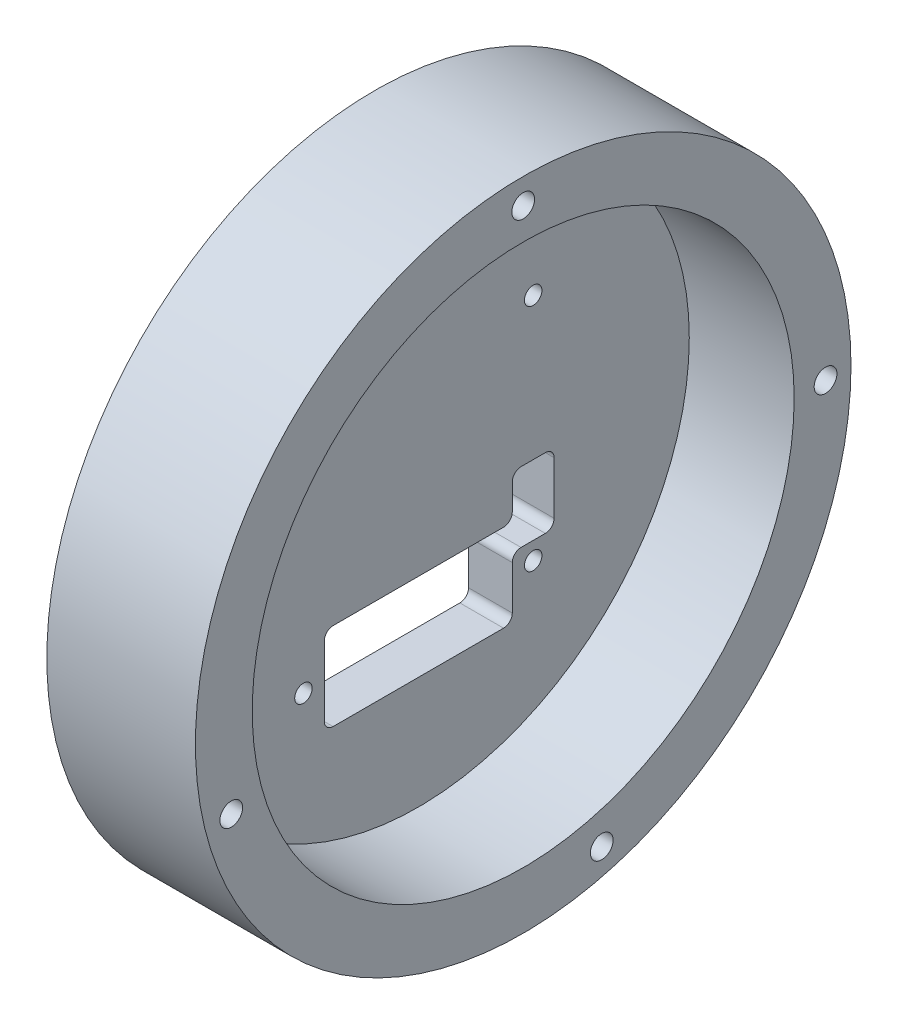
ISO-10303-21;
HEADER;
FILE_DESCRIPTION(('STEP AP214'),'2;1');
FILE_NAME('part.step','',(''),(''),'','','');
FILE_SCHEMA(('AUTOMOTIVE_DESIGN { 1 0 10303 214 1 1 1 1 }'));
ENDSEC;
DATA;
#1=APPLICATION_CONTEXT('core data for automotive mechanical design processes');
#2=APPLICATION_PROTOCOL_DEFINITION('international standard','automotive_design',2000,#1);
#3=PRODUCT_CONTEXT('',#1,'mechanical');
#4=PRODUCT('Part','Part','',(#3));
#5=PRODUCT_RELATED_PRODUCT_CATEGORY('part','',(#4));
#6=PRODUCT_DEFINITION_FORMATION('','',#4);
#7=PRODUCT_DEFINITION_CONTEXT('part definition',#1,'design');
#8=PRODUCT_DEFINITION('design','',#6,#7);
#9=PRODUCT_DEFINITION_SHAPE('','',#8);
#10=(LENGTH_UNIT() NAMED_UNIT(*) SI_UNIT(.MILLI.,.METRE.));
#11=(NAMED_UNIT(*) PLANE_ANGLE_UNIT() SI_UNIT($,.RADIAN.));
#12=(NAMED_UNIT(*) SI_UNIT($,.STERADIAN.) SOLID_ANGLE_UNIT());
#13=UNCERTAINTY_MEASURE_WITH_UNIT(LENGTH_MEASURE(1.E-05),#10,'distance_accuracy_value','');
#14=(GEOMETRIC_REPRESENTATION_CONTEXT(3) GLOBAL_UNCERTAINTY_ASSIGNED_CONTEXT((#13)) GLOBAL_UNIT_ASSIGNED_CONTEXT((#10,
#11,#12)) REPRESENTATION_CONTEXT('',''));
#15=CARTESIAN_POINT('',(0.,0.,0.));
#16=DIRECTION('',(0.,0.,1.));
#17=DIRECTION('',(1.,0.,0.));
#18=AXIS2_PLACEMENT_3D('',#15,#16,#17);
#19=CARTESIAN_POINT('',(5.,0.,0.));
#20=DIRECTION('',(1.,0.,0.));
#21=DIRECTION('',(0.,0.,-1.));
#22=AXIS2_PLACEMENT_3D('',#19,#20,#21);
#23=PLANE('',#22);
#24=CARTESIAN_POINT('',(5.,-12.14,-11.7499999999993));
#25=DIRECTION('',(-1.,0.,0.));
#26=DIRECTION('',(0.,0.,-1.));
#27=AXIS2_PLACEMENT_3D('',#24,#25,#26);
#28=CIRCLE('',#27,0.999999999999999);
#29=CARTESIAN_POINT('',(5.,-12.14,-10.7499999999993));
#30=VERTEX_POINT('',#29);
#31=CARTESIAN_POINT('',(5.,-11.14,-11.7499999999993));
#32=VERTEX_POINT('',#31);
#33=EDGE_CURVE('E48',#30,#32,#28,.T.);
#34=ORIENTED_EDGE('',*,*,#33,.F.);
#35=DIRECTION('',(0.,1.,0.));
#36=VECTOR('',#35,1.);
#37=CARTESIAN_POINT('',(5.,-12.14,-10.7499999999993));
#38=LINE('',#37,#36);
#39=CARTESIAN_POINT('',(5.,-17.14,-10.7499999999993));
#40=VERTEX_POINT('',#39);
#41=EDGE_CURVE('E165',#40,#30,#38,.T.);
#42=ORIENTED_EDGE('',*,*,#41,.F.);
#43=CARTESIAN_POINT('',(5.,-17.14,-9.74999999999926));
#44=DIRECTION('',(1.,0.,0.));
#45=DIRECTION('',(0.,0.,1.));
#46=AXIS2_PLACEMENT_3D('',#43,#44,#45);
#47=CIRCLE('',#46,1.);
#48=CARTESIAN_POINT('',(5.,-18.14,-9.74999999999926));
#49=VERTEX_POINT('',#48);
#50=EDGE_CURVE('E168',#49,#40,#47,.T.);
#51=ORIENTED_EDGE('',*,*,#50,.F.);
#52=DIRECTION('',(0.,0.,-1.));
#53=VECTOR('',#52,1.);
#54=CARTESIAN_POINT('',(5.,-18.14,-9.74999999999926));
#55=LINE('',#54,#53);
#56=CARTESIAN_POINT('',(5.,-18.14,9.75000000000074));
#57=VERTEX_POINT('',#56);
#58=EDGE_CURVE('E244',#57,#49,#55,.T.);
#59=ORIENTED_EDGE('',*,*,#58,.F.);
#60=CARTESIAN_POINT('',(5.,-17.14,9.75000000000074));
#61=DIRECTION('',(1.,0.,0.));
#62=DIRECTION('',(0.,0.,1.));
#63=AXIS2_PLACEMENT_3D('',#60,#61,#62);
#64=CIRCLE('',#63,1.);
#65=CARTESIAN_POINT('',(5.,-17.14,10.7500000000007));
#66=VERTEX_POINT('',#65);
#67=EDGE_CURVE('E241',#66,#57,#64,.T.);
#68=ORIENTED_EDGE('',*,*,#67,.F.);
#69=DIRECTION('',(0.,-1.,0.));
#70=VECTOR('',#69,1.);
#71=CARTESIAN_POINT('',(5.,-9.14,10.7500000000007));
#72=LINE('',#71,#70);
#73=CARTESIAN_POINT('',(5.,-9.14,10.7500000000007));
#74=VERTEX_POINT('',#73);
#75=EDGE_CURVE('E238',#74,#66,#72,.T.);
#76=ORIENTED_EDGE('',*,*,#75,.F.);
#77=CARTESIAN_POINT('',(5.,-9.14,9.75000000000074));
#78=DIRECTION('',(1.,0.,0.));
#79=DIRECTION('',(0.,0.,1.));
#80=AXIS2_PLACEMENT_3D('',#77,#78,#79);
#81=CIRCLE('',#80,0.999999999999997);
#82=CARTESIAN_POINT('',(5.,-8.14,9.75000000000074));
#83=VERTEX_POINT('',#82);
#84=EDGE_CURVE('E235',#83,#74,#81,.T.);
#85=ORIENTED_EDGE('',*,*,#84,.F.);
#86=DIRECTION('',(0.,0.,1.));
#87=VECTOR('',#86,1.);
#88=CARTESIAN_POINT('',(5.,-8.14,-9.74999999999926));
#89=LINE('',#88,#87);
#90=CARTESIAN_POINT('',(5.,-8.14,-9.74999999999926));
#91=VERTEX_POINT('',#90);
#92=EDGE_CURVE('E232',#91,#83,#89,.T.);
#93=ORIENTED_EDGE('',*,*,#92,.F.);
#94=CARTESIAN_POINT('',(5.,-7.14,-9.74999999999926));
#95=DIRECTION('',(-1.,0.,0.));
#96=DIRECTION('',(0.,0.,-1.));
#97=AXIS2_PLACEMENT_3D('',#94,#95,#96);
#98=CIRCLE('',#97,1.);
#99=CARTESIAN_POINT('',(5.,-7.14,-10.7499999999993));
#100=VERTEX_POINT('',#99);
#101=EDGE_CURVE('E229',#100,#91,#98,.T.);
#102=ORIENTED_EDGE('',*,*,#101,.F.);
#103=DIRECTION('',(0.,-1.,0.));
#104=VECTOR('',#103,1.);
#105=CARTESIAN_POINT('',(5.,-4.14,-10.7499999999993));
#106=LINE('',#105,#104);
#107=CARTESIAN_POINT('',(5.,-4.14,-10.7499999999993));
#108=VERTEX_POINT('',#107);
#109=EDGE_CURVE('E226',#108,#100,#106,.T.);
#110=ORIENTED_EDGE('',*,*,#109,.F.);
#111=CARTESIAN_POINT('',(5.,-4.14,-11.7499999999993));
#112=DIRECTION('',(1.,0.,0.));
#113=DIRECTION('',(0.,0.,1.));
#114=AXIS2_PLACEMENT_3D('',#111,#112,#113);
#115=CIRCLE('',#114,1.);
#116=CARTESIAN_POINT('',(5.,-3.14,-11.7499999999993));
#117=VERTEX_POINT('',#116);
#118=EDGE_CURVE('E223',#117,#108,#115,.T.);
#119=ORIENTED_EDGE('',*,*,#118,.F.);
#120=DIRECTION('',(0.,0.,1.));
#121=VECTOR('',#120,1.);
#122=CARTESIAN_POINT('',(5.,-3.14,-14.5299999999993));
#123=LINE('',#122,#121);
#124=CARTESIAN_POINT('',(5.,-3.14,-14.5299999999993));
#125=VERTEX_POINT('',#124);
#126=EDGE_CURVE('E220',#125,#117,#123,.T.);
#127=ORIENTED_EDGE('',*,*,#126,.F.);
#128=CARTESIAN_POINT('',(5.,-4.14,-14.5299999999993));
#129=DIRECTION('',(1.,0.,0.));
#130=DIRECTION('',(0.,0.,-1.));
#131=AXIS2_PLACEMENT_3D('',#128,#129,#130);
#132=CIRCLE('',#131,1.);
#133=CARTESIAN_POINT('',(5.,-4.14,-15.5299999999993));
#134=VERTEX_POINT('',#133);
#135=EDGE_CURVE('E217',#134,#125,#132,.T.);
#136=ORIENTED_EDGE('',*,*,#135,.F.);
#137=DIRECTION('',(0.,1.,0.));
#138=VECTOR('',#137,1.);
#139=CARTESIAN_POINT('',(5.,-4.14,-15.5299999999993));
#140=LINE('',#139,#138);
#141=CARTESIAN_POINT('',(5.,-10.14,-15.5299999999993));
#142=VERTEX_POINT('',#141);
#143=EDGE_CURVE('E214',#142,#134,#140,.T.);
#144=ORIENTED_EDGE('',*,*,#143,.F.);
#145=CARTESIAN_POINT('',(5.,-10.14,-14.5299999999993));
#146=DIRECTION('',(1.,0.,0.));
#147=DIRECTION('',(0.,0.,1.));
#148=AXIS2_PLACEMENT_3D('',#145,#146,#147);
#149=CIRCLE('',#148,0.999999999999999);
#150=CARTESIAN_POINT('',(5.,-11.14,-14.5299999999993));
#151=VERTEX_POINT('',#150);
#152=EDGE_CURVE('E211',#151,#142,#149,.T.);
#153=ORIENTED_EDGE('',*,*,#152,.F.);
#154=DIRECTION('',(0.,0.,-1.));
#155=VECTOR('',#154,1.);
#156=CARTESIAN_POINT('',(5.,-11.14,-14.5299999999993));
#157=LINE('',#156,#155);
#158=EDGE_CURVE('E209',#32,#151,#157,.T.);
#159=ORIENTED_EDGE('',*,*,#158,.F.);
#160=EDGE_LOOP('',(#34,#42,#51,#59,#68,#76,#85,#93,#102,#110,#119,#127,#136,#144,#153,#159));
#161=FACE_BOUND('',#160,.T.);
#162=CARTESIAN_POINT('',(5.,13.14,-13.14));
#163=DIRECTION('',(-1.,0.,0.));
#164=DIRECTION('',(0.,0.,1.));
#165=AXIS2_PLACEMENT_3D('',#162,#163,#164);
#166=CIRCLE('',#165,1.);
#167=CARTESIAN_POINT('',(5.,13.14,-12.14));
#168=VERTEX_POINT('',#167);
#169=EDGE_CURVE('E327',#168,#168,#166,.T.);
#170=ORIENTED_EDGE('',*,*,#169,.T.);
#171=EDGE_LOOP('',(#170));
#172=FACE_BOUND('',#171,.T.);
#173=CARTESIAN_POINT('',(5.,13.1400000000007,13.14));
#174=DIRECTION('',(-1.,0.,0.));
#175=DIRECTION('',(0.,0.,1.));
#176=AXIS2_PLACEMENT_3D('',#173,#174,#175);
#177=CIRCLE('',#176,1.00000000000076);
#178=CARTESIAN_POINT('',(5.,13.1400000000007,14.1400000000008));
#179=VERTEX_POINT('',#178);
#180=EDGE_CURVE('E309',#179,#179,#177,.T.);
#181=ORIENTED_EDGE('',*,*,#180,.T.);
#182=EDGE_LOOP('',(#181));
#183=FACE_BOUND('',#182,.T.);
#184=CARTESIAN_POINT('',(5.,-13.1399999999993,13.1400000000007));
#185=DIRECTION('',(-1.,0.,0.));
#186=DIRECTION('',(0.,0.,1.));
#187=AXIS2_PLACEMENT_3D('',#184,#185,#186);
#188=CIRCLE('',#187,1.00000000000104);
#189=CARTESIAN_POINT('',(5.,-13.1399999999993,14.1400000000018));
#190=VERTEX_POINT('',#189);
#191=EDGE_CURVE('E316',#190,#190,#188,.T.);
#192=ORIENTED_EDGE('',*,*,#191,.T.);
#193=EDGE_LOOP('',(#192));
#194=FACE_BOUND('',#193,.T.);
#195=CARTESIAN_POINT('',(5.,-13.14,-13.1399999999993));
#196=DIRECTION('',(-1.,0.,0.));
#197=DIRECTION('',(0.,0.,1.));
#198=AXIS2_PLACEMENT_3D('',#195,#196,#197);
#199=CIRCLE('',#198,1.00000000000039);
#200=CARTESIAN_POINT('',(5.,-13.14,-12.1399999999989));
#201=VERTEX_POINT('',#200);
#202=EDGE_CURVE('E322',#201,#201,#199,.T.);
#203=ORIENTED_EDGE('',*,*,#202,.T.);
#204=EDGE_LOOP('',(#203));
#205=FACE_BOUND('',#204,.T.);
#206=CARTESIAN_POINT('',(5.,0.,0.));
#207=DIRECTION('',(1.,0.,0.));
#208=DIRECTION('',(0.,0.,-1.));
#209=AXIS2_PLACEMENT_3D('',#206,#207,#208);
#210=CIRCLE('',#209,31.);
#211=CARTESIAN_POINT('',(5.,0.,-31.));
#212=VERTEX_POINT('',#211);
#213=EDGE_CURVE('E11',#212,#212,#210,.F.);
#214=ORIENTED_EDGE('',*,*,#213,.F.);
#215=EDGE_LOOP('',(#214));
#216=FACE_BOUND('',#215,.T.);
#217=ADVANCED_FACE('F33',(#161,#172,#183,#194,#205,#216),#23,.T.);
#218=CARTESIAN_POINT('',(5.,0.,0.));
#219=DIRECTION('',(-1.,0.,0.));
#220=DIRECTION('',(0.,0.,1.));
#221=AXIS2_PLACEMENT_3D('',#218,#219,#220);
#222=CYLINDRICAL_SURFACE('',#221,37.5);
#223=CARTESIAN_POINT('',(0.,0.,0.));
#224=DIRECTION('',(1.,0.,0.));
#225=DIRECTION('',(0.,0.,-1.));
#226=AXIS2_PLACEMENT_3D('',#223,#224,#225);
#227=CIRCLE('',#226,37.5);
#228=CARTESIAN_POINT('',(0.,0.,-37.5));
#229=VERTEX_POINT('',#228);
#230=EDGE_CURVE('E41',#229,#229,#227,.T.);
#231=ORIENTED_EDGE('',*,*,#230,.T.);
#232=EDGE_LOOP('',(#231));
#233=FACE_BOUND('',#232,.T.);
#234=CARTESIAN_POINT('',(17.,0.,0.));
#235=DIRECTION('',(1.,0.,0.));
#236=DIRECTION('',(0.,0.,-1.));
#237=AXIS2_PLACEMENT_3D('',#234,#235,#236);
#238=CIRCLE('',#237,37.5);
#239=CARTESIAN_POINT('',(17.,0.,-37.5));
#240=VERTEX_POINT('',#239);
#241=EDGE_CURVE('E305',#240,#240,#238,.T.);
#242=ORIENTED_EDGE('',*,*,#241,.F.);
#243=EDGE_LOOP('',(#242));
#244=FACE_BOUND('',#243,.T.);
#245=ADVANCED_FACE('F35',(#233,#244),#222,.T.);
#246=CARTESIAN_POINT('',(0.,0.,0.));
#247=DIRECTION('',(1.,0.,0.));
#248=DIRECTION('',(0.,0.,-1.));
#249=AXIS2_PLACEMENT_3D('',#246,#247,#248);
#250=PLANE('',#249);
#251=DIRECTION('',(0.,1.,0.));
#252=VECTOR('',#251,1.);
#253=CARTESIAN_POINT('',(0.,-12.14,-10.7499999999993));
#254=LINE('',#253,#252);
#255=CARTESIAN_POINT('',(0.,-17.14,-10.7499999999993));
#256=VERTEX_POINT('',#255);
#257=CARTESIAN_POINT('',(0.,-12.14,-10.7499999999993));
#258=VERTEX_POINT('',#257);
#259=EDGE_CURVE('E154',#256,#258,#254,.T.);
#260=ORIENTED_EDGE('',*,*,#259,.T.);
#261=CARTESIAN_POINT('',(0.,-12.14,-11.7499999999993));
#262=DIRECTION('',(-1.,0.,0.));
#263=DIRECTION('',(0.,0.,-1.));
#264=AXIS2_PLACEMENT_3D('',#261,#262,#263);
#265=CIRCLE('',#264,0.999999999999999);
#266=CARTESIAN_POINT('',(0.,-11.14,-11.7499999999993));
#267=VERTEX_POINT('',#266);
#268=EDGE_CURVE('E148',#258,#267,#265,.T.);
#269=ORIENTED_EDGE('',*,*,#268,.T.);
#270=DIRECTION('',(0.,0.,-1.));
#271=VECTOR('',#270,1.);
#272=CARTESIAN_POINT('',(0.,-11.14,-14.5299999999993));
#273=LINE('',#272,#271);
#274=CARTESIAN_POINT('',(0.,-11.14,-14.5299999999993));
#275=VERTEX_POINT('',#274);
#276=EDGE_CURVE('E157',#267,#275,#273,.T.);
#277=ORIENTED_EDGE('',*,*,#276,.T.);
#278=CARTESIAN_POINT('',(0.,-10.14,-14.5299999999993));
#279=DIRECTION('',(1.,0.,0.));
#280=DIRECTION('',(0.,0.,1.));
#281=AXIS2_PLACEMENT_3D('',#278,#279,#280);
#282=CIRCLE('',#281,0.999999999999999);
#283=CARTESIAN_POINT('',(0.,-10.14,-15.5299999999993));
#284=VERTEX_POINT('',#283);
#285=EDGE_CURVE('E56',#275,#284,#282,.T.);
#286=ORIENTED_EDGE('',*,*,#285,.T.);
#287=DIRECTION('',(0.,1.,0.));
#288=VECTOR('',#287,1.);
#289=CARTESIAN_POINT('',(0.,-4.14,-15.5299999999993));
#290=LINE('',#289,#288);
#291=CARTESIAN_POINT('',(0.,-4.14,-15.5299999999993));
#292=VERTEX_POINT('',#291);
#293=EDGE_CURVE('E172',#284,#292,#290,.T.);
#294=ORIENTED_EDGE('',*,*,#293,.T.);
#295=CARTESIAN_POINT('',(0.,-4.14,-14.5299999999993));
#296=DIRECTION('',(1.,0.,0.));
#297=DIRECTION('',(0.,0.,-1.));
#298=AXIS2_PLACEMENT_3D('',#295,#296,#297);
#299=CIRCLE('',#298,1.);
#300=CARTESIAN_POINT('',(0.,-3.14,-14.5299999999993));
#301=VERTEX_POINT('',#300);
#302=EDGE_CURVE('E175',#292,#301,#299,.T.);
#303=ORIENTED_EDGE('',*,*,#302,.T.);
#304=DIRECTION('',(0.,0.,1.));
#305=VECTOR('',#304,1.);
#306=CARTESIAN_POINT('',(0.,-3.14,-14.5299999999993));
#307=LINE('',#306,#305);
#308=CARTESIAN_POINT('',(0.,-3.14,-11.7499999999993));
#309=VERTEX_POINT('',#308);
#310=EDGE_CURVE('E178',#301,#309,#307,.T.);
#311=ORIENTED_EDGE('',*,*,#310,.T.);
#312=CARTESIAN_POINT('',(0.,-4.14,-11.7499999999993));
#313=DIRECTION('',(1.,0.,0.));
#314=DIRECTION('',(0.,0.,1.));
#315=AXIS2_PLACEMENT_3D('',#312,#313,#314);
#316=CIRCLE('',#315,1.);
#317=CARTESIAN_POINT('',(0.,-4.14,-10.7499999999993));
#318=VERTEX_POINT('',#317);
#319=EDGE_CURVE('E181',#309,#318,#316,.T.);
#320=ORIENTED_EDGE('',*,*,#319,.T.);
#321=DIRECTION('',(0.,-1.,0.));
#322=VECTOR('',#321,1.);
#323=CARTESIAN_POINT('',(0.,-4.14,-10.7499999999993));
#324=LINE('',#323,#322);
#325=CARTESIAN_POINT('',(0.,-7.14,-10.7499999999993));
#326=VERTEX_POINT('',#325);
#327=EDGE_CURVE('E184',#318,#326,#324,.T.);
#328=ORIENTED_EDGE('',*,*,#327,.T.);
#329=CARTESIAN_POINT('',(0.,-7.14,-9.74999999999926));
#330=DIRECTION('',(-1.,0.,0.));
#331=DIRECTION('',(0.,0.,-1.));
#332=AXIS2_PLACEMENT_3D('',#329,#330,#331);
#333=CIRCLE('',#332,1.);
#334=CARTESIAN_POINT('',(0.,-8.14,-9.74999999999926));
#335=VERTEX_POINT('',#334);
#336=EDGE_CURVE('E187',#326,#335,#333,.T.);
#337=ORIENTED_EDGE('',*,*,#336,.T.);
#338=DIRECTION('',(0.,0.,1.));
#339=VECTOR('',#338,1.);
#340=CARTESIAN_POINT('',(0.,-8.14,-9.74999999999926));
#341=LINE('',#340,#339);
#342=CARTESIAN_POINT('',(0.,-8.14,9.75000000000074));
#343=VERTEX_POINT('',#342);
#344=EDGE_CURVE('E190',#335,#343,#341,.T.);
#345=ORIENTED_EDGE('',*,*,#344,.T.);
#346=CARTESIAN_POINT('',(0.,-9.14,9.75000000000074));
#347=DIRECTION('',(1.,0.,0.));
#348=DIRECTION('',(0.,0.,1.));
#349=AXIS2_PLACEMENT_3D('',#346,#347,#348);
#350=CIRCLE('',#349,0.999999999999997);
#351=CARTESIAN_POINT('',(0.,-9.14,10.7500000000007));
#352=VERTEX_POINT('',#351);
#353=EDGE_CURVE('E193',#343,#352,#350,.T.);
#354=ORIENTED_EDGE('',*,*,#353,.T.);
#355=DIRECTION('',(0.,-1.,0.));
#356=VECTOR('',#355,1.);
#357=CARTESIAN_POINT('',(0.,-9.14,10.7500000000007));
#358=LINE('',#357,#356);
#359=CARTESIAN_POINT('',(0.,-17.14,10.7500000000007));
#360=VERTEX_POINT('',#359);
#361=EDGE_CURVE('E196',#352,#360,#358,.T.);
#362=ORIENTED_EDGE('',*,*,#361,.T.);
#363=CARTESIAN_POINT('',(0.,-17.14,9.75000000000074));
#364=DIRECTION('',(1.,0.,0.));
#365=DIRECTION('',(0.,0.,1.));
#366=AXIS2_PLACEMENT_3D('',#363,#364,#365);
#367=CIRCLE('',#366,1.);
#368=CARTESIAN_POINT('',(0.,-18.14,9.75000000000074));
#369=VERTEX_POINT('',#368);
#370=EDGE_CURVE('E199',#360,#369,#367,.T.);
#371=ORIENTED_EDGE('',*,*,#370,.T.);
#372=DIRECTION('',(0.,0.,-1.));
#373=VECTOR('',#372,1.);
#374=CARTESIAN_POINT('',(0.,-18.14,-9.74999999999926));
#375=LINE('',#374,#373);
#376=CARTESIAN_POINT('',(0.,-18.14,-9.74999999999926));
#377=VERTEX_POINT('',#376);
#378=EDGE_CURVE('E202',#369,#377,#375,.T.);
#379=ORIENTED_EDGE('',*,*,#378,.T.);
#380=CARTESIAN_POINT('',(0.,-17.14,-9.74999999999926));
#381=DIRECTION('',(1.,0.,0.));
#382=DIRECTION('',(0.,0.,1.));
#383=AXIS2_PLACEMENT_3D('',#380,#381,#382);
#384=CIRCLE('',#383,1.);
#385=EDGE_CURVE('E205',#377,#256,#384,.T.);
#386=ORIENTED_EDGE('',*,*,#385,.T.);
#387=EDGE_LOOP('',(#260,#269,#277,#286,#294,#303,#311,#320,#328,#337,#345,#354,#362,#371,#379,#386));
#388=FACE_BOUND('',#387,.T.);
#389=CARTESIAN_POINT('',(0.,34.5880982268056,0.));
#390=DIRECTION('',(1.,0.,0.));
#391=DIRECTION('',(0.,0.,-1.));
#392=AXIS2_PLACEMENT_3D('',#389,#390,#391);
#393=CIRCLE('',#392,1.3);
#394=CARTESIAN_POINT('',(0.,34.5880982268056,-1.3));
#395=VERTEX_POINT('',#394);
#396=EDGE_CURVE('E282',#395,#395,#393,.T.);
#397=ORIENTED_EDGE('',*,*,#396,.T.);
#398=EDGE_LOOP('',(#397));
#399=FACE_BOUND('',#398,.T.);
#400=CARTESIAN_POINT('',(0.,-33.400843650823,-8.9844411267719));
#401=DIRECTION('',(1.,0.,0.));
#402=DIRECTION('',(0.,0.,-1.));
#403=AXIS2_PLACEMENT_3D('',#400,#401,#402);
#404=CIRCLE('',#403,1.30000000000016);
#405=CARTESIAN_POINT('',(0.,-33.400843650823,-10.2844411267721));
#406=VERTEX_POINT('',#405);
#407=EDGE_CURVE('E283',#406,#406,#404,.T.);
#408=ORIENTED_EDGE('',*,*,#407,.T.);
#409=EDGE_LOOP('',(#408));
#410=FACE_BOUND('',#409,.T.);
#411=CARTESIAN_POINT('',(0.,7.69499886461159E-12,-34.5880982268095));
#412=DIRECTION('',(1.,0.,0.));
#413=DIRECTION('',(0.,0.,-1.));
#414=AXIS2_PLACEMENT_3D('',#411,#412,#413);
#415=CIRCLE('',#414,1.3);
#416=CARTESIAN_POINT('',(0.,7.69499886461159E-12,-35.8880982268095));
#417=VERTEX_POINT('',#416);
#418=EDGE_CURVE('E290',#417,#417,#415,.T.);
#419=ORIENTED_EDGE('',*,*,#418,.T.);
#420=EDGE_LOOP('',(#419));
#421=FACE_BOUND('',#420,.T.);
#422=CARTESIAN_POINT('',(0.,-8.98444112677168,33.4008436508182));
#423=DIRECTION('',(1.,0.,0.));
#424=DIRECTION('',(0.,0.,-1.));
#425=AXIS2_PLACEMENT_3D('',#422,#423,#424);
#426=CIRCLE('',#425,1.29999999999996);
#427=CARTESIAN_POINT('',(0.,-8.98444112677168,32.1008436508182));
#428=VERTEX_POINT('',#427);
#429=EDGE_CURVE('E296',#428,#428,#426,.T.);
#430=ORIENTED_EDGE('',*,*,#429,.T.);
#431=EDGE_LOOP('',(#430));
#432=FACE_BOUND('',#431,.T.);
#433=CARTESIAN_POINT('',(0.,-13.14,-13.1399999999993));
#434=DIRECTION('',(-1.,0.,0.));
#435=DIRECTION('',(0.,0.,1.));
#436=AXIS2_PLACEMENT_3D('',#433,#434,#435);
#437=CIRCLE('',#436,1.00000000000039);
#438=CARTESIAN_POINT('',(0.,-13.14,-12.1399999999989));
#439=VERTEX_POINT('',#438);
#440=EDGE_CURVE('E308',#439,#439,#437,.T.);
#441=ORIENTED_EDGE('',*,*,#440,.F.);
#442=EDGE_LOOP('',(#441));
#443=FACE_BOUND('',#442,.T.);
#444=CARTESIAN_POINT('',(0.,-13.1399999999993,13.1400000000007));
#445=DIRECTION('',(-1.,0.,0.));
#446=DIRECTION('',(0.,0.,1.));
#447=AXIS2_PLACEMENT_3D('',#444,#445,#446);
#448=CIRCLE('',#447,1.00000000000104);
#449=CARTESIAN_POINT('',(0.,-13.1399999999993,14.1400000000018));
#450=VERTEX_POINT('',#449);
#451=EDGE_CURVE('E319',#450,#450,#448,.T.);
#452=ORIENTED_EDGE('',*,*,#451,.F.);
#453=EDGE_LOOP('',(#452));
#454=FACE_BOUND('',#453,.T.);
#455=CARTESIAN_POINT('',(0.,13.1400000000007,13.14));
#456=DIRECTION('',(-1.,0.,0.));
#457=DIRECTION('',(0.,0.,1.));
#458=AXIS2_PLACEMENT_3D('',#455,#456,#457);
#459=CIRCLE('',#458,1.00000000000076);
#460=CARTESIAN_POINT('',(0.,13.1400000000007,14.1400000000008));
#461=VERTEX_POINT('',#460);
#462=EDGE_CURVE('E313',#461,#461,#459,.T.);
#463=ORIENTED_EDGE('',*,*,#462,.F.);
#464=EDGE_LOOP('',(#463));
#465=FACE_BOUND('',#464,.T.);
#466=CARTESIAN_POINT('',(0.,13.14,-13.14));
#467=DIRECTION('',(-1.,0.,0.));
#468=DIRECTION('',(0.,0.,1.));
#469=AXIS2_PLACEMENT_3D('',#466,#467,#468);
#470=CIRCLE('',#469,1.);
#471=CARTESIAN_POINT('',(0.,13.14,-12.14));
#472=VERTEX_POINT('',#471);
#473=EDGE_CURVE('E312',#472,#472,#470,.T.);
#474=ORIENTED_EDGE('',*,*,#473,.F.);
#475=EDGE_LOOP('',(#474));
#476=FACE_BOUND('',#475,.T.);
#477=ORIENTED_EDGE('',*,*,#230,.F.);
#478=EDGE_LOOP('',(#477));
#479=FACE_BOUND('',#478,.T.);
#480=ADVANCED_FACE('F161',(#388,#399,#410,#421,#432,#443,#454,#465,#476,#479),#250,.F.);
#481=CARTESIAN_POINT('',(5.,13.14,-13.14));
#482=DIRECTION('',(-1.,0.,0.));
#483=DIRECTION('',(0.,0.,1.));
#484=AXIS2_PLACEMENT_3D('',#481,#482,#483);
#485=CYLINDRICAL_SURFACE('',#484,1.);
#486=ORIENTED_EDGE('',*,*,#169,.F.);
#487=EDGE_LOOP('',(#486));
#488=FACE_BOUND('',#487,.T.);
#489=ORIENTED_EDGE('',*,*,#473,.T.);
#490=EDGE_LOOP('',(#489));
#491=FACE_BOUND('',#490,.T.);
#492=ADVANCED_FACE('F337',(#488,#491),#485,.F.);
#493=CARTESIAN_POINT('',(5.,13.1400000000007,13.14));
#494=DIRECTION('',(-1.,0.,0.));
#495=DIRECTION('',(0.,0.,1.));
#496=AXIS2_PLACEMENT_3D('',#493,#494,#495);
#497=CYLINDRICAL_SURFACE('',#496,1.00000000000076);
#498=ORIENTED_EDGE('',*,*,#180,.F.);
#499=EDGE_LOOP('',(#498));
#500=FACE_BOUND('',#499,.T.);
#501=ORIENTED_EDGE('',*,*,#462,.T.);
#502=EDGE_LOOP('',(#501));
#503=FACE_BOUND('',#502,.T.);
#504=ADVANCED_FACE('F342',(#500,#503),#497,.F.);
#505=CARTESIAN_POINT('',(5.,-13.1399999999993,13.1400000000007));
#506=DIRECTION('',(-1.,0.,0.));
#507=DIRECTION('',(0.,0.,1.));
#508=AXIS2_PLACEMENT_3D('',#505,#506,#507);
#509=CYLINDRICAL_SURFACE('',#508,1.00000000000104);
#510=ORIENTED_EDGE('',*,*,#191,.F.);
#511=EDGE_LOOP('',(#510));
#512=FACE_BOUND('',#511,.T.);
#513=ORIENTED_EDGE('',*,*,#451,.T.);
#514=EDGE_LOOP('',(#513));
#515=FACE_BOUND('',#514,.T.);
#516=ADVANCED_FACE('F356',(#512,#515),#509,.F.);
#517=CARTESIAN_POINT('',(5.,-13.14,-13.1399999999993));
#518=DIRECTION('',(-1.,0.,0.));
#519=DIRECTION('',(0.,0.,1.));
#520=AXIS2_PLACEMENT_3D('',#517,#518,#519);
#521=CYLINDRICAL_SURFACE('',#520,1.00000000000039);
#522=ORIENTED_EDGE('',*,*,#202,.F.);
#523=EDGE_LOOP('',(#522));
#524=FACE_BOUND('',#523,.T.);
#525=ORIENTED_EDGE('',*,*,#440,.T.);
#526=EDGE_LOOP('',(#525));
#527=FACE_BOUND('',#526,.T.);
#528=ADVANCED_FACE('F352',(#524,#527),#521,.F.);
#529=CARTESIAN_POINT('',(17.,0.,0.));
#530=DIRECTION('',(1.,0.,0.));
#531=DIRECTION('',(0.,0.,-1.));
#532=AXIS2_PLACEMENT_3D('',#529,#530,#531);
#533=PLANE('',#532);
#534=CARTESIAN_POINT('',(17.,34.5880982268056,0.));
#535=DIRECTION('',(1.,0.,0.));
#536=DIRECTION('',(0.,0.,-1.));
#537=AXIS2_PLACEMENT_3D('',#534,#535,#536);
#538=CIRCLE('',#537,1.3);
#539=CARTESIAN_POINT('',(17.,34.5880982268056,-1.3));
#540=VERTEX_POINT('',#539);
#541=EDGE_CURVE('E279',#540,#540,#538,.T.);
#542=ORIENTED_EDGE('',*,*,#541,.F.);
#543=EDGE_LOOP('',(#542));
#544=FACE_BOUND('',#543,.T.);
#545=CARTESIAN_POINT('',(17.,-33.400843650823,-8.9844411267719));
#546=DIRECTION('',(1.,0.,0.));
#547=DIRECTION('',(0.,0.,-1.));
#548=AXIS2_PLACEMENT_3D('',#545,#546,#547);
#549=CIRCLE('',#548,1.30000000000016);
#550=CARTESIAN_POINT('',(17.,-33.400843650823,-10.2844411267721));
#551=VERTEX_POINT('',#550);
#552=EDGE_CURVE('E287',#551,#551,#549,.T.);
#553=ORIENTED_EDGE('',*,*,#552,.F.);
#554=EDGE_LOOP('',(#553));
#555=FACE_BOUND('',#554,.T.);
#556=CARTESIAN_POINT('',(17.,7.69499886461159E-12,-34.5880982268095));
#557=DIRECTION('',(1.,0.,0.));
#558=DIRECTION('',(0.,0.,-1.));
#559=AXIS2_PLACEMENT_3D('',#556,#557,#558);
#560=CIRCLE('',#559,1.3);
#561=CARTESIAN_POINT('',(17.,7.69499886461159E-12,-35.8880982268095));
#562=VERTEX_POINT('',#561);
#563=EDGE_CURVE('E293',#562,#562,#560,.T.);
#564=ORIENTED_EDGE('',*,*,#563,.F.);
#565=EDGE_LOOP('',(#564));
#566=FACE_BOUND('',#565,.T.);
#567=CARTESIAN_POINT('',(17.,-8.98444112677168,33.4008436508182));
#568=DIRECTION('',(1.,0.,0.));
#569=DIRECTION('',(0.,0.,-1.));
#570=AXIS2_PLACEMENT_3D('',#567,#568,#569);
#571=CIRCLE('',#570,1.29999999999996);
#572=CARTESIAN_POINT('',(17.,-8.98444112677168,32.1008436508182));
#573=VERTEX_POINT('',#572);
#574=EDGE_CURVE('E251',#573,#573,#571,.T.);
#575=ORIENTED_EDGE('',*,*,#574,.F.);
#576=EDGE_LOOP('',(#575));
#577=FACE_BOUND('',#576,.T.);
#578=ORIENTED_EDGE('',*,*,#241,.T.);
#579=EDGE_LOOP('',(#578));
#580=FACE_BOUND('',#579,.T.);
#581=CARTESIAN_POINT('',(17.,0.,0.));
#582=DIRECTION('',(1.,0.,0.));
#583=DIRECTION('',(0.,0.,-1.));
#584=AXIS2_PLACEMENT_3D('',#581,#582,#583);
#585=CIRCLE('',#584,31.);
#586=CARTESIAN_POINT('',(17.,0.,-31.));
#587=VERTEX_POINT('',#586);
#588=EDGE_CURVE('E286',#587,#587,#585,.T.);
#589=ORIENTED_EDGE('',*,*,#588,.F.);
#590=EDGE_LOOP('',(#589));
#591=FACE_BOUND('',#590,.T.);
#592=ADVANCED_FACE('F355',(#544,#555,#566,#577,#580,#591),#533,.T.);
#593=CARTESIAN_POINT('',(17.,0.,0.));
#594=DIRECTION('',(-1.,0.,0.));
#595=DIRECTION('',(0.,0.,1.));
#596=AXIS2_PLACEMENT_3D('',#593,#594,#595);
#597=CYLINDRICAL_SURFACE('',#596,31.);
#598=ORIENTED_EDGE('',*,*,#588,.T.);
#599=EDGE_LOOP('',(#598));
#600=FACE_BOUND('',#599,.T.);
#601=ORIENTED_EDGE('',*,*,#213,.T.);
#602=EDGE_LOOP('',(#601));
#603=FACE_BOUND('',#602,.T.);
#604=ADVANCED_FACE('F366',(#600,#603),#597,.F.);
#605=CARTESIAN_POINT('',(0.,-8.98444112677168,33.4008436508182));
#606=DIRECTION('',(1.,0.,0.));
#607=DIRECTION('',(0.,0.,-1.));
#608=AXIS2_PLACEMENT_3D('',#605,#606,#607);
#609=CYLINDRICAL_SURFACE('',#608,1.29999999999996);
#610=ORIENTED_EDGE('',*,*,#429,.F.);
#611=EDGE_LOOP('',(#610));
#612=FACE_BOUND('',#611,.T.);
#613=ORIENTED_EDGE('',*,*,#574,.T.);
#614=EDGE_LOOP('',(#613));
#615=FACE_BOUND('',#614,.T.);
#616=ADVANCED_FACE('F370',(#612,#615),#609,.F.);
#617=CARTESIAN_POINT('',(0.,7.69499886461159E-12,-34.5880982268095));
#618=DIRECTION('',(1.,0.,0.));
#619=DIRECTION('',(0.,0.,-1.));
#620=AXIS2_PLACEMENT_3D('',#617,#618,#619);
#621=CYLINDRICAL_SURFACE('',#620,1.3);
#622=ORIENTED_EDGE('',*,*,#418,.F.);
#623=EDGE_LOOP('',(#622));
#624=FACE_BOUND('',#623,.T.);
#625=ORIENTED_EDGE('',*,*,#563,.T.);
#626=EDGE_LOOP('',(#625));
#627=FACE_BOUND('',#626,.T.);
#628=ADVANCED_FACE('F374',(#624,#627),#621,.F.);
#629=CARTESIAN_POINT('',(0.,-33.400843650823,-8.9844411267719));
#630=DIRECTION('',(1.,0.,0.));
#631=DIRECTION('',(0.,0.,-1.));
#632=AXIS2_PLACEMENT_3D('',#629,#630,#631);
#633=CYLINDRICAL_SURFACE('',#632,1.30000000000016);
#634=ORIENTED_EDGE('',*,*,#407,.F.);
#635=EDGE_LOOP('',(#634));
#636=FACE_BOUND('',#635,.T.);
#637=ORIENTED_EDGE('',*,*,#552,.T.);
#638=EDGE_LOOP('',(#637));
#639=FACE_BOUND('',#638,.T.);
#640=ADVANCED_FACE('F378',(#636,#639),#633,.F.);
#641=CARTESIAN_POINT('',(0.,34.5880982268056,0.));
#642=DIRECTION('',(1.,0.,0.));
#643=DIRECTION('',(0.,0.,-1.));
#644=AXIS2_PLACEMENT_3D('',#641,#642,#643);
#645=CYLINDRICAL_SURFACE('',#644,1.3);
#646=ORIENTED_EDGE('',*,*,#396,.F.);
#647=EDGE_LOOP('',(#646));
#648=FACE_BOUND('',#647,.T.);
#649=ORIENTED_EDGE('',*,*,#541,.T.);
#650=EDGE_LOOP('',(#649));
#651=FACE_BOUND('',#650,.T.);
#652=ADVANCED_FACE('F382',(#648,#651),#645,.F.);
#653=CARTESIAN_POINT('',(0.,-12.14,-11.7499999999993));
#654=DIRECTION('',(1.,0.,0.));
#655=DIRECTION('',(0.,0.,-1.));
#656=AXIS2_PLACEMENT_3D('',#653,#654,#655);
#657=CYLINDRICAL_SURFACE('',#656,0.999999999999999);
#658=ORIENTED_EDGE('',*,*,#33,.T.);
#659=DIRECTION('',(1.,0.,0.));
#660=VECTOR('',#659,1.);
#661=CARTESIAN_POINT('',(0.,-11.14,-11.7499999999993));
#662=LINE('',#661,#660);
#663=EDGE_CURVE('E144',#267,#32,#662,.T.);
#664=ORIENTED_EDGE('',*,*,#663,.F.);
#665=ORIENTED_EDGE('',*,*,#268,.F.);
#666=DIRECTION('',(1.,0.,0.));
#667=VECTOR('',#666,1.);
#668=CARTESIAN_POINT('',(0.,-12.14,-10.7499999999993));
#669=LINE('',#668,#667);
#670=EDGE_CURVE('E249',#258,#30,#669,.T.);
#671=ORIENTED_EDGE('',*,*,#670,.T.);
#672=EDGE_LOOP('',(#658,#664,#665,#671));
#673=FACE_BOUND('',#672,.T.);
#674=ADVANCED_FACE('F146',(#673),#657,.T.);
#675=CARTESIAN_POINT('',(0.,-12.14,-10.7499999999993));
#676=DIRECTION('',(0.,0.,-1.));
#677=DIRECTION('',(-1.,0.,0.));
#678=AXIS2_PLACEMENT_3D('',#675,#676,#677);
#679=PLANE('',#678);
#680=ORIENTED_EDGE('',*,*,#41,.T.);
#681=ORIENTED_EDGE('',*,*,#670,.F.);
#682=ORIENTED_EDGE('',*,*,#259,.F.);
#683=DIRECTION('',(1.,0.,0.));
#684=VECTOR('',#683,1.);
#685=CARTESIAN_POINT('',(0.,-17.14,-10.7499999999993));
#686=LINE('',#685,#684);
#687=EDGE_CURVE('E252',#256,#40,#686,.T.);
#688=ORIENTED_EDGE('',*,*,#687,.T.);
#689=EDGE_LOOP('',(#680,#681,#682,#688));
#690=FACE_BOUND('',#689,.T.);
#691=ADVANCED_FACE('F389',(#690),#679,.F.);
#692=CARTESIAN_POINT('',(0.,-17.14,-9.74999999999926));
#693=DIRECTION('',(1.,0.,0.));
#694=DIRECTION('',(0.,0.,-1.));
#695=AXIS2_PLACEMENT_3D('',#692,#693,#694);
#696=CYLINDRICAL_SURFACE('',#695,1.);
#697=ORIENTED_EDGE('',*,*,#50,.T.);
#698=ORIENTED_EDGE('',*,*,#687,.F.);
#699=ORIENTED_EDGE('',*,*,#385,.F.);
#700=DIRECTION('',(1.,0.,0.));
#701=VECTOR('',#700,1.);
#702=CARTESIAN_POINT('',(0.,-18.14,-9.74999999999926));
#703=LINE('',#702,#701);
#704=EDGE_CURVE('E254',#377,#49,#703,.T.);
#705=ORIENTED_EDGE('',*,*,#704,.T.);
#706=EDGE_LOOP('',(#697,#698,#699,#705));
#707=FACE_BOUND('',#706,.T.);
#708=ADVANCED_FACE('F438',(#707),#696,.F.);
#709=CARTESIAN_POINT('',(0.,-18.14,-9.74999999999926));
#710=DIRECTION('',(0.,-1.,0.));
#711=DIRECTION('',(0.,0.,-1.));
#712=AXIS2_PLACEMENT_3D('',#709,#710,#711);
#713=PLANE('',#712);
#714=ORIENTED_EDGE('',*,*,#58,.T.);
#715=ORIENTED_EDGE('',*,*,#704,.F.);
#716=ORIENTED_EDGE('',*,*,#378,.F.);
#717=DIRECTION('',(1.,0.,0.));
#718=VECTOR('',#717,1.);
#719=CARTESIAN_POINT('',(0.,-18.14,9.75000000000074));
#720=LINE('',#719,#718);
#721=EDGE_CURVE('E256',#369,#57,#720,.T.);
#722=ORIENTED_EDGE('',*,*,#721,.T.);
#723=EDGE_LOOP('',(#714,#715,#716,#722));
#724=FACE_BOUND('',#723,.T.);
#725=ADVANCED_FACE('F434',(#724),#713,.F.);
#726=CARTESIAN_POINT('',(0.,-17.14,9.75000000000074));
#727=DIRECTION('',(1.,0.,0.));
#728=DIRECTION('',(0.,0.,-1.));
#729=AXIS2_PLACEMENT_3D('',#726,#727,#728);
#730=CYLINDRICAL_SURFACE('',#729,1.);
#731=ORIENTED_EDGE('',*,*,#67,.T.);
#732=ORIENTED_EDGE('',*,*,#721,.F.);
#733=ORIENTED_EDGE('',*,*,#370,.F.);
#734=DIRECTION('',(1.,0.,0.));
#735=VECTOR('',#734,1.);
#736=CARTESIAN_POINT('',(0.,-17.14,10.7500000000007));
#737=LINE('',#736,#735);
#738=EDGE_CURVE('E258',#360,#66,#737,.T.);
#739=ORIENTED_EDGE('',*,*,#738,.T.);
#740=EDGE_LOOP('',(#731,#732,#733,#739));
#741=FACE_BOUND('',#740,.T.);
#742=ADVANCED_FACE('F430',(#741),#730,.F.);
#743=CARTESIAN_POINT('',(0.,-9.14,10.7500000000007));
#744=DIRECTION('',(0.,0.,1.));
#745=DIRECTION('',(0.,-1.,0.));
#746=AXIS2_PLACEMENT_3D('',#743,#744,#745);
#747=PLANE('',#746);
#748=ORIENTED_EDGE('',*,*,#75,.T.);
#749=ORIENTED_EDGE('',*,*,#738,.F.);
#750=ORIENTED_EDGE('',*,*,#361,.F.);
#751=DIRECTION('',(1.,0.,0.));
#752=VECTOR('',#751,1.);
#753=CARTESIAN_POINT('',(0.,-9.14,10.7500000000007));
#754=LINE('',#753,#752);
#755=EDGE_CURVE('E260',#352,#74,#754,.T.);
#756=ORIENTED_EDGE('',*,*,#755,.T.);
#757=EDGE_LOOP('',(#748,#749,#750,#756));
#758=FACE_BOUND('',#757,.T.);
#759=ADVANCED_FACE('F426',(#758),#747,.F.);
#760=CARTESIAN_POINT('',(0.,-9.14,9.75000000000074));
#761=DIRECTION('',(1.,0.,0.));
#762=DIRECTION('',(0.,0.,-1.));
#763=AXIS2_PLACEMENT_3D('',#760,#761,#762);
#764=CYLINDRICAL_SURFACE('',#763,0.999999999999997);
#765=ORIENTED_EDGE('',*,*,#84,.T.);
#766=ORIENTED_EDGE('',*,*,#755,.F.);
#767=ORIENTED_EDGE('',*,*,#353,.F.);
#768=DIRECTION('',(1.,0.,0.));
#769=VECTOR('',#768,1.);
#770=CARTESIAN_POINT('',(0.,-8.14,9.75000000000074));
#771=LINE('',#770,#769);
#772=EDGE_CURVE('E262',#343,#83,#771,.T.);
#773=ORIENTED_EDGE('',*,*,#772,.T.);
#774=EDGE_LOOP('',(#765,#766,#767,#773));
#775=FACE_BOUND('',#774,.T.);
#776=ADVANCED_FACE('F422',(#775),#764,.F.);
#777=CARTESIAN_POINT('',(0.,-8.14,-9.74999999999926));
#778=DIRECTION('',(0.,1.,0.));
#779=DIRECTION('',(0.,0.,1.));
#780=AXIS2_PLACEMENT_3D('',#777,#778,#779);
#781=PLANE('',#780);
#782=ORIENTED_EDGE('',*,*,#92,.T.);
#783=ORIENTED_EDGE('',*,*,#772,.F.);
#784=ORIENTED_EDGE('',*,*,#344,.F.);
#785=DIRECTION('',(1.,0.,0.));
#786=VECTOR('',#785,1.);
#787=CARTESIAN_POINT('',(0.,-8.14,-9.74999999999926));
#788=LINE('',#787,#786);
#789=EDGE_CURVE('E264',#335,#91,#788,.T.);
#790=ORIENTED_EDGE('',*,*,#789,.T.);
#791=EDGE_LOOP('',(#782,#783,#784,#790));
#792=FACE_BOUND('',#791,.T.);
#793=ADVANCED_FACE('F418',(#792),#781,.F.);
#794=CARTESIAN_POINT('',(0.,-7.14,-9.74999999999926));
#795=DIRECTION('',(1.,0.,0.));
#796=DIRECTION('',(0.,0.,-1.));
#797=AXIS2_PLACEMENT_3D('',#794,#795,#796);
#798=CYLINDRICAL_SURFACE('',#797,1.);
#799=ORIENTED_EDGE('',*,*,#101,.T.);
#800=ORIENTED_EDGE('',*,*,#789,.F.);
#801=ORIENTED_EDGE('',*,*,#336,.F.);
#802=DIRECTION('',(1.,0.,0.));
#803=VECTOR('',#802,1.);
#804=CARTESIAN_POINT('',(0.,-7.14,-10.7499999999993));
#805=LINE('',#804,#803);
#806=EDGE_CURVE('E266',#326,#100,#805,.T.);
#807=ORIENTED_EDGE('',*,*,#806,.T.);
#808=EDGE_LOOP('',(#799,#800,#801,#807));
#809=FACE_BOUND('',#808,.T.);
#810=ADVANCED_FACE('F414',(#809),#798,.T.);
#811=CARTESIAN_POINT('',(0.,-4.14,-10.7499999999993));
#812=DIRECTION('',(0.,0.,1.));
#813=DIRECTION('',(0.,-1.,0.));
#814=AXIS2_PLACEMENT_3D('',#811,#812,#813);
#815=PLANE('',#814);
#816=ORIENTED_EDGE('',*,*,#109,.T.);
#817=ORIENTED_EDGE('',*,*,#806,.F.);
#818=ORIENTED_EDGE('',*,*,#327,.F.);
#819=DIRECTION('',(1.,0.,0.));
#820=VECTOR('',#819,1.);
#821=CARTESIAN_POINT('',(0.,-4.14,-10.7499999999993));
#822=LINE('',#821,#820);
#823=EDGE_CURVE('E268',#318,#108,#822,.T.);
#824=ORIENTED_EDGE('',*,*,#823,.T.);
#825=EDGE_LOOP('',(#816,#817,#818,#824));
#826=FACE_BOUND('',#825,.T.);
#827=ADVANCED_FACE('F410',(#826),#815,.F.);
#828=CARTESIAN_POINT('',(0.,-4.14,-11.7499999999993));
#829=DIRECTION('',(1.,0.,0.));
#830=DIRECTION('',(0.,0.,-1.));
#831=AXIS2_PLACEMENT_3D('',#828,#829,#830);
#832=CYLINDRICAL_SURFACE('',#831,1.);
#833=ORIENTED_EDGE('',*,*,#118,.T.);
#834=ORIENTED_EDGE('',*,*,#823,.F.);
#835=ORIENTED_EDGE('',*,*,#319,.F.);
#836=DIRECTION('',(1.,0.,0.));
#837=VECTOR('',#836,1.);
#838=CARTESIAN_POINT('',(0.,-3.14,-11.7499999999993));
#839=LINE('',#838,#837);
#840=EDGE_CURVE('E270',#309,#117,#839,.T.);
#841=ORIENTED_EDGE('',*,*,#840,.T.);
#842=EDGE_LOOP('',(#833,#834,#835,#841));
#843=FACE_BOUND('',#842,.T.);
#844=ADVANCED_FACE('F406',(#843),#832,.F.);
#845=CARTESIAN_POINT('',(0.,-3.14,-14.5299999999993));
#846=DIRECTION('',(0.,1.,0.));
#847=DIRECTION('',(0.,0.,1.));
#848=AXIS2_PLACEMENT_3D('',#845,#846,#847);
#849=PLANE('',#848);
#850=ORIENTED_EDGE('',*,*,#126,.T.);
#851=ORIENTED_EDGE('',*,*,#840,.F.);
#852=ORIENTED_EDGE('',*,*,#310,.F.);
#853=DIRECTION('',(1.,0.,0.));
#854=VECTOR('',#853,1.);
#855=CARTESIAN_POINT('',(0.,-3.14,-14.5299999999993));
#856=LINE('',#855,#854);
#857=EDGE_CURVE('E272',#301,#125,#856,.T.);
#858=ORIENTED_EDGE('',*,*,#857,.T.);
#859=EDGE_LOOP('',(#850,#851,#852,#858));
#860=FACE_BOUND('',#859,.T.);
#861=ADVANCED_FACE('F402',(#860),#849,.F.);
#862=CARTESIAN_POINT('',(0.,-4.14,-14.5299999999993));
#863=DIRECTION('',(1.,0.,0.));
#864=DIRECTION('',(0.,0.,-1.));
#865=AXIS2_PLACEMENT_3D('',#862,#863,#864);
#866=CYLINDRICAL_SURFACE('',#865,1.);
#867=ORIENTED_EDGE('',*,*,#135,.T.);
#868=ORIENTED_EDGE('',*,*,#857,.F.);
#869=ORIENTED_EDGE('',*,*,#302,.F.);
#870=DIRECTION('',(1.,0.,0.));
#871=VECTOR('',#870,1.);
#872=CARTESIAN_POINT('',(0.,-4.14,-15.5299999999993));
#873=LINE('',#872,#871);
#874=EDGE_CURVE('E274',#292,#134,#873,.T.);
#875=ORIENTED_EDGE('',*,*,#874,.T.);
#876=EDGE_LOOP('',(#867,#868,#869,#875));
#877=FACE_BOUND('',#876,.T.);
#878=ADVANCED_FACE('F398',(#877),#866,.F.);
#879=CARTESIAN_POINT('',(0.,-4.14,-15.5299999999993));
#880=DIRECTION('',(0.,0.,-1.));
#881=DIRECTION('',(-1.,0.,0.));
#882=AXIS2_PLACEMENT_3D('',#879,#880,#881);
#883=PLANE('',#882);
#884=ORIENTED_EDGE('',*,*,#143,.T.);
#885=ORIENTED_EDGE('',*,*,#874,.F.);
#886=ORIENTED_EDGE('',*,*,#293,.F.);
#887=DIRECTION('',(1.,0.,0.));
#888=VECTOR('',#887,1.);
#889=CARTESIAN_POINT('',(0.,-10.14,-15.5299999999993));
#890=LINE('',#889,#888);
#891=EDGE_CURVE('E276',#284,#142,#890,.T.);
#892=ORIENTED_EDGE('',*,*,#891,.T.);
#893=EDGE_LOOP('',(#884,#885,#886,#892));
#894=FACE_BOUND('',#893,.T.);
#895=ADVANCED_FACE('F395',(#894),#883,.F.);
#896=CARTESIAN_POINT('',(0.,-10.14,-14.5299999999993));
#897=DIRECTION('',(1.,0.,0.));
#898=DIRECTION('',(0.,0.,-1.));
#899=AXIS2_PLACEMENT_3D('',#896,#897,#898);
#900=CYLINDRICAL_SURFACE('',#899,0.999999999999999);
#901=ORIENTED_EDGE('',*,*,#152,.T.);
#902=ORIENTED_EDGE('',*,*,#891,.F.);
#903=ORIENTED_EDGE('',*,*,#285,.F.);
#904=DIRECTION('',(1.,0.,0.));
#905=VECTOR('',#904,1.);
#906=CARTESIAN_POINT('',(0.,-11.14,-14.5299999999993));
#907=LINE('',#906,#905);
#908=EDGE_CURVE('E153',#275,#151,#907,.T.);
#909=ORIENTED_EDGE('',*,*,#908,.T.);
#910=EDGE_LOOP('',(#901,#902,#903,#909));
#911=FACE_BOUND('',#910,.T.);
#912=ADVANCED_FACE('F392',(#911),#900,.F.);
#913=CARTESIAN_POINT('',(0.,-11.14,-14.5299999999993));
#914=DIRECTION('',(0.,-1.,0.));
#915=DIRECTION('',(0.,0.,-1.));
#916=AXIS2_PLACEMENT_3D('',#913,#914,#915);
#917=PLANE('',#916);
#918=ORIENTED_EDGE('',*,*,#158,.T.);
#919=ORIENTED_EDGE('',*,*,#908,.F.);
#920=ORIENTED_EDGE('',*,*,#276,.F.);
#921=ORIENTED_EDGE('',*,*,#663,.T.);
#922=EDGE_LOOP('',(#918,#919,#920,#921));
#923=FACE_BOUND('',#922,.T.);
#924=ADVANCED_FACE('F158',(#923),#917,.F.);
#925=CLOSED_SHELL('',(#217,#245,#480,#492,#504,#516,#528,#592,#604,#616,#628,#640,#652,#674,
#691,#708,#725,#742,#759,#776,#793,#810,#827,#844,#861,#878,#895,#912,#924));
#926=MANIFOLD_SOLID_BREP('B2',#925);
#927=ADVANCED_BREP_SHAPE_REPRESENTATION('',(#18,#926),#14);
#928=SHAPE_DEFINITION_REPRESENTATION(#9,#927);
ENDSEC;
END-ISO-10303-21;
